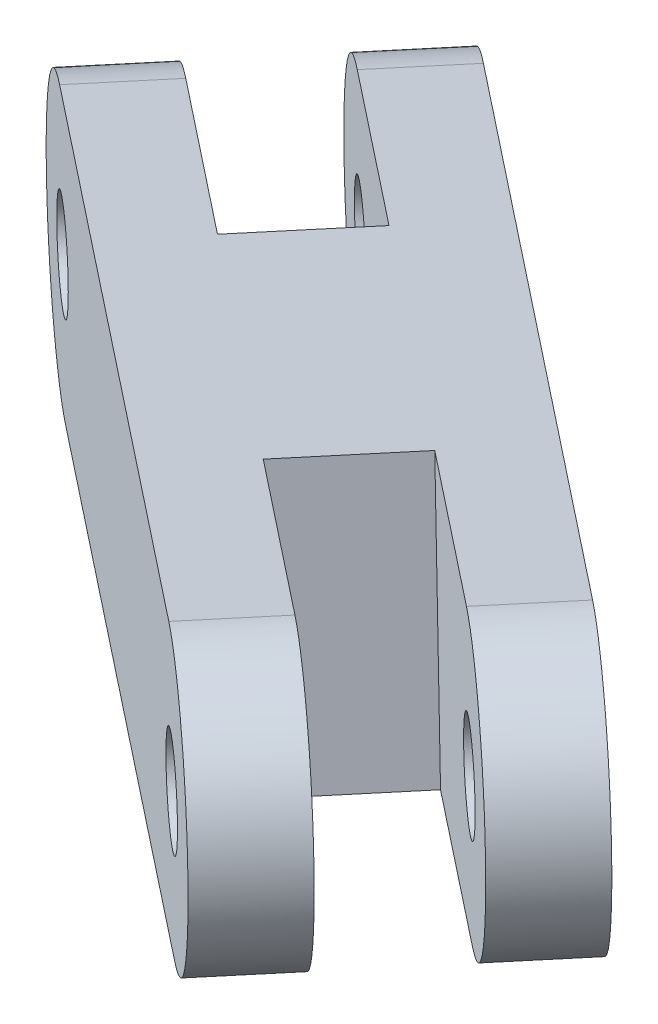
ISO-10303-21;
HEADER;
FILE_DESCRIPTION(('STEP AP214'),'2;1');
FILE_NAME('part.step','',(''),(''),'','','');
FILE_SCHEMA(('AUTOMOTIVE_DESIGN { 1 0 10303 214 1 1 1 1 }'));
ENDSEC;
DATA;
#1=APPLICATION_CONTEXT('core data for automotive mechanical design processes');
#2=APPLICATION_PROTOCOL_DEFINITION('international standard','automotive_design',2000,#1);
#3=PRODUCT_CONTEXT('',#1,'mechanical');
#4=PRODUCT('Part','Part','',(#3));
#5=PRODUCT_RELATED_PRODUCT_CATEGORY('part','',(#4));
#6=PRODUCT_DEFINITION_FORMATION('','',#4);
#7=PRODUCT_DEFINITION_CONTEXT('part definition',#1,'design');
#8=PRODUCT_DEFINITION('design','',#6,#7);
#9=PRODUCT_DEFINITION_SHAPE('','',#8);
#10=(LENGTH_UNIT() NAMED_UNIT(*) SI_UNIT(.MILLI.,.METRE.));
#11=(NAMED_UNIT(*) PLANE_ANGLE_UNIT() SI_UNIT($,.RADIAN.));
#12=(NAMED_UNIT(*) SI_UNIT($,.STERADIAN.) SOLID_ANGLE_UNIT());
#13=UNCERTAINTY_MEASURE_WITH_UNIT(LENGTH_MEASURE(1.E-05),#10,'distance_accuracy_value','');
#14=(GEOMETRIC_REPRESENTATION_CONTEXT(3) GLOBAL_UNCERTAINTY_ASSIGNED_CONTEXT((#13)) GLOBAL_UNIT_ASSIGNED_CONTEXT((#10,
#11,#12)) REPRESENTATION_CONTEXT('',''));
#15=CARTESIAN_POINT('',(0.,0.,0.));
#16=DIRECTION('',(0.,0.,1.));
#17=DIRECTION('',(1.,0.,0.));
#18=AXIS2_PLACEMENT_3D('',#15,#16,#17);
#19=CARTESIAN_POINT('',(-10.2761149388828,3.16770857727477,-37.3203668764532));
#20=DIRECTION('',(-0.642787609686537,0.,0.76604444311898));
#21=DIRECTION('',(0.76604444311898,0.,0.642787609686537));
#22=AXIS2_PLACEMENT_3D('',#19,#20,#21);
#23=CYLINDRICAL_SURFACE('',#22,4.699);
#24=DIRECTION('',(-0.642787609686537,0.,0.76604444311898));
#25=VECTOR('',#24,1.);
#26=CARTESIAN_POINT('',(-9.63957530738413,-1.45723833501612,-36.786246706433));
#27=LINE('',#26,#25);
#28=CARTESIAN_POINT('',(-9.63957530738413,-1.45723833501612,-36.786246706433));
#29=VERTEX_POINT('',#28);
#30=CARTESIAN_POINT('',(-11.6804259681389,-1.45723833501612,-34.3540555995302));
#31=VERTEX_POINT('',#30);
#32=EDGE_CURVE('E224',#29,#31,#27,.T.);
#33=ORIENTED_EDGE('',*,*,#32,.T.);
#34=CARTESIAN_POINT('',(-12.3169655996375,3.16770857727477,-34.8881757695505));
#35=DIRECTION('',(0.642787609686537,0.,-0.76604444311898));
#36=DIRECTION('',(-0.76604444311898,0.,-0.642787609686537));
#37=AXIS2_PLACEMENT_3D('',#34,#35,#36);
#38=CIRCLE('',#37,4.699);
#39=CARTESIAN_POINT('',(-12.9535052311362,7.79265548956567,-35.4222959395707));
#40=VERTEX_POINT('',#39);
#41=EDGE_CURVE('E174',#40,#31,#38,.F.);
#42=ORIENTED_EDGE('',*,*,#41,.F.);
#43=DIRECTION('',(-0.642787609686537,0.,0.76604444311898));
#44=VECTOR('',#43,1.);
#45=CARTESIAN_POINT('',(-10.9126545703814,7.79265548956567,-37.8544870464735));
#46=LINE('',#45,#44);
#47=CARTESIAN_POINT('',(-10.9126545703814,7.79265548956567,-37.8544870464735));
#48=VERTEX_POINT('',#47);
#49=EDGE_CURVE('E213',#48,#40,#46,.T.);
#50=ORIENTED_EDGE('',*,*,#49,.F.);
#51=CARTESIAN_POINT('',(-10.2761149388828,3.16770857727477,-37.3203668764532));
#52=DIRECTION('',(-0.642787609686537,0.,0.76604444311898));
#53=DIRECTION('',(0.76604444311898,0.,0.642787609686537));
#54=AXIS2_PLACEMENT_3D('',#51,#52,#53);
#55=CIRCLE('',#54,4.699);
#56=EDGE_CURVE('E200',#48,#29,#55,.T.);
#57=ORIENTED_EDGE('',*,*,#56,.T.);
#58=EDGE_LOOP('',(#33,#42,#50,#57));
#59=FACE_BOUND('',#58,.T.);
#60=ADVANCED_FACE('F34',(#59),#23,.T.);
#61=CARTESIAN_POINT('',(13.7884699315781,8.81173628923763,-17.1277825872153));
#62=DIRECTION('',(-0.642787609686537,0.,0.76604444311898));
#63=DIRECTION('',(0.76604444311898,0.,0.642787609686537));
#64=AXIS2_PLACEMENT_3D('',#61,#62,#63);
#65=CYLINDRICAL_SURFACE('',#64,4.699);
#66=CARTESIAN_POINT('',(8.97206237219681,8.81173628923763,-11.3878115749248));
#67=DIRECTION('',(-0.64278760968654,0.,0.766044443118978));
#68=DIRECTION('',(0.766044443118978,0.,0.64278760968654));
#69=AXIS2_PLACEMENT_3D('',#66,#67,#68);
#70=CIRCLE('',#69,4.699);
#71=CARTESIAN_POINT('',(8.33552274069816,13.4366832015285,-11.921931744945));
#72=VERTEX_POINT('',#71);
#73=CARTESIAN_POINT('',(9.60860200369546,4.18678937694673,-10.8536914049045));
#74=VERTEX_POINT('',#73);
#75=EDGE_CURVE('E165',#72,#74,#70,.F.);
#76=ORIENTED_EDGE('',*,*,#75,.F.);
#77=DIRECTION('',(-0.642787609686537,0.,0.76604444311898));
#78=VECTOR('',#77,1.);
#79=CARTESIAN_POINT('',(13.1519303000794,13.4366832015285,-17.6619027572355));
#80=LINE('',#79,#78);
#81=CARTESIAN_POINT('',(6.29467207994342,13.4366832015285,-9.48974063804226));
#82=VERTEX_POINT('',#81);
#83=EDGE_CURVE('E219',#72,#82,#80,.T.);
#84=ORIENTED_EDGE('',*,*,#83,.T.);
#85=CARTESIAN_POINT('',(6.93121171144207,8.81173628923763,-8.95562046802202));
#86=DIRECTION('',(-0.642787609686537,0.,0.76604444311898));
#87=DIRECTION('',(-0.76604444311898,0.,-0.642787609686537));
#88=AXIS2_PLACEMENT_3D('',#85,#86,#87);
#89=CIRCLE('',#88,4.699);
#90=CARTESIAN_POINT('',(7.56775134294073,4.18678937694673,-8.42150029800179));
#91=VERTEX_POINT('',#90);
#92=EDGE_CURVE('E188',#91,#82,#89,.T.);
#93=ORIENTED_EDGE('',*,*,#92,.F.);
#94=DIRECTION('',(-0.642787609686537,0.,0.76604444311898));
#95=VECTOR('',#94,1.);
#96=CARTESIAN_POINT('',(14.4250095630767,4.18678937694673,-16.5936624171951));
#97=LINE('',#96,#95);
#98=EDGE_CURVE('E223',#74,#91,#97,.T.);
#99=ORIENTED_EDGE('',*,*,#98,.F.);
#100=EDGE_LOOP('',(#76,#84,#93,#99));
#101=FACE_BOUND('',#100,.T.);
#102=ADVANCED_FACE('F274',(#101),#65,.T.);
#103=CARTESIAN_POINT('',(-10.2761149388828,3.16770857727477,-37.3203668764532));
#104=DIRECTION('',(-0.642787609686537,0.,0.76604444311898));
#105=DIRECTION('',(0.76604444311898,0.,0.642787609686537));
#106=AXIS2_PLACEMENT_3D('',#103,#104,#105);
#107=CYLINDRICAL_SURFACE('',#106,1.651);
#108=CARTESIAN_POINT('',(-12.3169655996375,3.16770857727477,-34.8881757695505));
#109=DIRECTION('',(0.642787609686537,0.,-0.76604444311898));
#110=DIRECTION('',(-0.76604444311898,0.,-0.642787609686537));
#111=AXIS2_PLACEMENT_3D('',#108,#109,#110);
#112=CIRCLE('',#111,1.651);
#113=CARTESIAN_POINT('',(-13.581704975227,3.16770857727477,-35.9494181131429));
#114=VERTEX_POINT('',#113);
#115=EDGE_CURVE('E171',#114,#114,#112,.F.);
#116=ORIENTED_EDGE('',*,*,#115,.T.);
#117=EDGE_LOOP('',(#116));
#118=FACE_BOUND('',#117,.T.);
#119=CARTESIAN_POINT('',(-10.2761149388828,3.16770857727477,-37.3203668764532));
#120=DIRECTION('',(-0.642787609686537,0.,0.76604444311898));
#121=DIRECTION('',(0.76604444311898,0.,0.642787609686537));
#122=AXIS2_PLACEMENT_3D('',#119,#120,#121);
#123=CIRCLE('',#122,1.651);
#124=CARTESIAN_POINT('',(-9.01137556329335,3.16770857727477,-36.2591245328608));
#125=VERTEX_POINT('',#124);
#126=EDGE_CURVE('E197',#125,#125,#123,.T.);
#127=ORIENTED_EDGE('',*,*,#126,.F.);
#128=EDGE_LOOP('',(#127));
#129=FACE_BOUND('',#128,.T.);
#130=ADVANCED_FACE('F285',(#118,#129),#107,.F.);
#131=CARTESIAN_POINT('',(13.7884699315781,8.81173628923763,-17.1277825872153));
#132=DIRECTION('',(-0.642787609686537,0.,0.76604444311898));
#133=DIRECTION('',(0.76604444311898,0.,0.642787609686537));
#134=AXIS2_PLACEMENT_3D('',#131,#132,#133);
#135=CYLINDRICAL_SURFACE('',#134,1.651);
#136=CARTESIAN_POINT('',(8.97206237219681,8.81173628923763,-11.3878115749248));
#137=DIRECTION('',(-0.64278760968654,0.,0.766044443118978));
#138=DIRECTION('',(0.766044443118978,0.,0.64278760968654));
#139=AXIS2_PLACEMENT_3D('',#136,#137,#138);
#140=CIRCLE('',#139,1.651);
#141=CARTESIAN_POINT('',(10.2368017477862,8.81173628923763,-10.3265692313323));
#142=VERTEX_POINT('',#141);
#143=EDGE_CURVE('E162',#142,#142,#140,.F.);
#144=ORIENTED_EDGE('',*,*,#143,.T.);
#145=EDGE_LOOP('',(#144));
#146=FACE_BOUND('',#145,.T.);
#147=CARTESIAN_POINT('',(6.93121171144207,8.81173628923763,-8.95562046802202));
#148=DIRECTION('',(-0.642787609686537,0.,0.76604444311898));
#149=DIRECTION('',(0.76604444311898,0.,0.642787609686537));
#150=AXIS2_PLACEMENT_3D('',#147,#148,#149);
#151=CIRCLE('',#150,1.651);
#152=CARTESIAN_POINT('',(8.19595108703151,8.81173628923763,-7.89437812442955));
#153=VERTEX_POINT('',#152);
#154=EDGE_CURVE('E176',#153,#153,#151,.T.);
#155=ORIENTED_EDGE('',*,*,#154,.T.);
#156=EDGE_LOOP('',(#155));
#157=FACE_BOUND('',#156,.T.);
#158=ADVANCED_FACE('F282',(#146,#157),#135,.F.);
#159=CARTESIAN_POINT('',(-15.092522498264,3.16770857727477,-31.5803958641627));
#160=DIRECTION('',(-0.642787609686537,0.,0.76604444311898));
#161=DIRECTION('',(0.76604444311898,0.,0.642787609686537));
#162=AXIS2_PLACEMENT_3D('',#159,#160,#161);
#163=CIRCLE('',#162,4.699);
#164=CARTESIAN_POINT('',(-14.4559828667654,-1.45723833501612,-31.0462756941425));
#165=VERTEX_POINT('',#164);
#166=CARTESIAN_POINT('',(-15.7290621297627,7.79265548956567,-32.1145160341829));
#167=VERTEX_POINT('',#166);
#168=EDGE_CURVE('E137',#165,#167,#163,.F.);
#169=ORIENTED_EDGE('',*,*,#168,.F.);
#170=CARTESIAN_POINT('',(-16.4968335275201,-1.45723833501612,-28.6140845872397));
#171=VERTEX_POINT('',#170);
#172=EDGE_CURVE('E212',#165,#171,#27,.T.);
#173=ORIENTED_EDGE('',*,*,#172,.T.);
#174=CARTESIAN_POINT('',(-17.1333731590188,3.16770857727477,-29.14820475726));
#175=DIRECTION('',(-0.642787609686537,0.,0.76604444311898));
#176=DIRECTION('',(0.76604444311898,0.,0.642787609686537));
#177=AXIS2_PLACEMENT_3D('',#174,#175,#176);
#178=CIRCLE('',#177,4.699);
#179=CARTESIAN_POINT('',(-17.7699127905174,7.79265548956567,-29.6823249272802));
#180=VERTEX_POINT('',#179);
#181=EDGE_CURVE('E182',#180,#171,#178,.T.);
#182=ORIENTED_EDGE('',*,*,#181,.F.);
#183=EDGE_CURVE('E215',#167,#180,#46,.T.);
#184=ORIENTED_EDGE('',*,*,#183,.F.);
#185=EDGE_LOOP('',(#169,#173,#182,#184));
#186=FACE_BOUND('',#185,.T.);
#187=ADVANCED_FACE('F36',(#186),#23,.T.);
#188=CARTESIAN_POINT('',(-10.9126545703814,7.79265548956567,-37.8544870464735));
#189=DIRECTION('',(-0.135462786018015,0.984240670842924,-0.113666773785962));
#190=DIRECTION('',(-0.990661215392179,-0.136346456931197,0.));
#191=AXIS2_PLACEMENT_3D('',#188,#189,#190);
#192=PLANE('',#191);
#193=DIRECTION('',(-0.753972096590918,-0.176834108301175,-0.632657708167397));
#194=VECTOR('',#193,1.);
#195=CARTESIAN_POINT('',(-16.4964201130169,6.96171201465845,-38.3951545102493));
#196=LINE('',#195,#194);
#197=CARTESIAN_POINT('',(-5.96342992364179,9.43208450762586,-29.5569263271508));
#198=VERTEX_POINT('',#197);
#199=EDGE_CURVE('E131',#198,#40,#196,.T.);
#200=ORIENTED_EDGE('',*,*,#199,.F.);
#201=DIRECTION('',(0.642787609686539,0.,-0.766044443118978));
#202=VECTOR('',#201,1.);
#203=CARTESIAN_POINT('',(-8.73898682226827,9.43208450762586,-26.249146421763));
#204=LINE('',#203,#202);
#205=CARTESIAN_POINT('',(-8.73898682226827,9.43208450762586,-26.249146421763));
#206=VERTEX_POINT('',#205);
#207=EDGE_CURVE('E126',#206,#198,#204,.T.);
#208=ORIENTED_EDGE('',*,*,#207,.F.);
#209=DIRECTION('',(0.753972096590919,0.176834108301175,0.632657708167397));
#210=VECTOR('',#209,1.);
#211=CARTESIAN_POINT('',(-19.2719770116434,6.96171201465845,-35.0873746048616));
#212=LINE('',#211,#210);
#213=EDGE_CURVE('E134',#167,#206,#212,.T.);
#214=ORIENTED_EDGE('',*,*,#213,.F.);
#215=ORIENTED_EDGE('',*,*,#183,.T.);
#216=DIRECTION('',(-0.753972096590919,-0.176834108301175,-0.632657708167397));
#217=VECTOR('',#216,1.);
#218=CARTESIAN_POINT('',(-17.7699127905174,7.79265548956567,-29.6823249272802));
#219=LINE('',#218,#217);
#220=EDGE_CURVE('E191',#82,#180,#219,.T.);
#221=ORIENTED_EDGE('',*,*,#220,.F.);
#222=ORIENTED_EDGE('',*,*,#83,.F.);
#223=DIRECTION('',(0.753972096590917,0.176834108301175,0.632657708167399));
#224=VECTOR('',#223,1.);
#225=CARTESIAN_POINT('',(11.8784376225789,14.2676266764357,-8.94907317426639));
#226=LINE('',#225,#224);
#227=CARTESIAN_POINT('',(1.34544743320377,11.7972541834683,-17.787301357365));
#228=VERTEX_POINT('',#227);
#229=EDGE_CURVE('E154',#228,#72,#226,.T.);
#230=ORIENTED_EDGE('',*,*,#229,.F.);
#231=DIRECTION('',(-0.642787609686539,0.,0.766044443118978));
#232=VECTOR('',#231,1.);
#233=CARTESIAN_POINT('',(4.12100433183025,11.7972541834683,-21.0950812627527));
#234=LINE('',#233,#232);
#235=CARTESIAN_POINT('',(4.12100433183025,11.7972541834683,-21.0950812627527));
#236=VERTEX_POINT('',#235);
#237=EDGE_CURVE('E151',#236,#228,#234,.T.);
#238=ORIENTED_EDGE('',*,*,#237,.F.);
#239=DIRECTION('',(-0.753972096590917,-0.176834108301175,-0.632657708167399));
#240=VECTOR('',#239,1.);
#241=CARTESIAN_POINT('',(14.6539945212054,14.2676266764357,-12.2568530796541));
#242=LINE('',#241,#240);
#243=CARTESIAN_POINT('',(11.1110796393246,13.4366832015285,-15.2297116503328));
#244=VERTEX_POINT('',#243);
#245=EDGE_CURVE('E149',#244,#236,#242,.T.);
#246=ORIENTED_EDGE('',*,*,#245,.F.);
#247=CARTESIAN_POINT('',(13.1519303000794,13.4366832015285,-17.6619027572355));
#248=VERTEX_POINT('',#247);
#249=EDGE_CURVE('E216',#248,#244,#80,.T.);
#250=ORIENTED_EDGE('',*,*,#249,.F.);
#251=DIRECTION('',(-0.753972096590919,-0.176834108301175,-0.632657708167397));
#252=VECTOR('',#251,1.);
#253=CARTESIAN_POINT('',(-10.9126545703814,7.79265548956567,-37.8544870464735));
#254=LINE('',#253,#252);
#255=EDGE_CURVE('E209',#248,#48,#254,.T.);
#256=ORIENTED_EDGE('',*,*,#255,.T.);
#257=ORIENTED_EDGE('',*,*,#49,.T.);
#258=EDGE_LOOP('',(#200,#208,#214,#215,#221,#222,#230,#238,#246,#250,#256,#257));
#259=FACE_BOUND('',#258,.T.);
#260=ADVANCED_FACE('F142',(#259),#192,.T.);
#261=CARTESIAN_POINT('',(11.7476192708233,8.81173628923763,-14.6955914803125));
#262=DIRECTION('',(0.642787609686539,0.,-0.766044443118978));
#263=DIRECTION('',(-0.766044443118978,0.,-0.642787609686539));
#264=AXIS2_PLACEMENT_3D('',#261,#262,#263);
#265=CIRCLE('',#264,4.699);
#266=CARTESIAN_POINT('',(12.3841589023219,4.18678937694673,-14.1614713102923));
#267=VERTEX_POINT('',#266);
#268=EDGE_CURVE('E160',#267,#244,#265,.F.);
#269=ORIENTED_EDGE('',*,*,#268,.F.);
#270=CARTESIAN_POINT('',(14.4250095630767,4.18678937694673,-16.5936624171951));
#271=VERTEX_POINT('',#270);
#272=EDGE_CURVE('E220',#271,#267,#97,.T.);
#273=ORIENTED_EDGE('',*,*,#272,.F.);
#274=CARTESIAN_POINT('',(13.7884699315781,8.81173628923763,-17.1277825872153));
#275=DIRECTION('',(-0.642787609686537,0.,0.76604444311898));
#276=DIRECTION('',(-0.76604444311898,0.,-0.642787609686537));
#277=AXIS2_PLACEMENT_3D('',#274,#275,#276);
#278=CIRCLE('',#277,4.699);
#279=EDGE_CURVE('E206',#271,#248,#278,.T.);
#280=ORIENTED_EDGE('',*,*,#279,.T.);
#281=ORIENTED_EDGE('',*,*,#249,.T.);
#282=EDGE_LOOP('',(#269,#273,#280,#281));
#283=FACE_BOUND('',#282,.T.);
#284=ADVANCED_FACE('F249',(#283),#65,.T.);
#285=CARTESIAN_POINT('',(-9.63957530738413,-1.45723833501612,-36.786246706433));
#286=DIRECTION('',(0.135462786018015,-0.984240670842924,0.113666773785962));
#287=DIRECTION('',(0.990661215392179,0.136346456931197,0.));
#288=AXIS2_PLACEMENT_3D('',#285,#286,#287);
#289=PLANE('',#288);
#290=DIRECTION('',(0.753972096590919,0.176834108301175,0.632657708167397));
#291=VECTOR('',#290,1.);
#292=CARTESIAN_POINT('',(-11.6804259681389,-1.45723833501612,-34.3540555995302));
#293=LINE('',#292,#291);
#294=CARTESIAN_POINT('',(-4.69035066064449,0.182190683044065,-28.4886859871103));
#295=VERTEX_POINT('',#294);
#296=EDGE_CURVE('E172',#31,#295,#293,.T.);
#297=ORIENTED_EDGE('',*,*,#296,.F.);
#298=ORIENTED_EDGE('',*,*,#32,.F.);
#299=DIRECTION('',(0.753972096590918,0.176834108301174,0.632657708167397));
#300=VECTOR('',#299,1.);
#301=CARTESIAN_POINT('',(-9.63957530738413,-1.45723833501612,-36.786246706433));
#302=LINE('',#301,#300);
#303=EDGE_CURVE('E203',#29,#271,#302,.T.);
#304=ORIENTED_EDGE('',*,*,#303,.T.);
#305=ORIENTED_EDGE('',*,*,#272,.T.);
#306=DIRECTION('',(0.753972096590917,0.176834108301174,0.632657708167399));
#307=VECTOR('',#306,1.);
#308=CARTESIAN_POINT('',(-11.6804259681389,-1.45723833501612,-34.3540555995303));
#309=LINE('',#308,#307);
#310=CARTESIAN_POINT('',(5.39408359482755,2.54736035888654,-20.0268409227122));
#311=VERTEX_POINT('',#310);
#312=EDGE_CURVE('E158',#311,#267,#309,.T.);
#313=ORIENTED_EDGE('',*,*,#312,.F.);
#314=DIRECTION('',(0.642787609686539,0.,-0.766044443118979));
#315=VECTOR('',#314,1.);
#316=CARTESIAN_POINT('',(7.43493425558229,2.54736035888655,-22.459032029615));
#317=LINE('',#316,#315);
#318=CARTESIAN_POINT('',(2.61852669620108,2.54736035888654,-16.7190610173245));
#319=VERTEX_POINT('',#318);
#320=EDGE_CURVE('E42',#319,#311,#317,.T.);
#321=ORIENTED_EDGE('',*,*,#320,.F.);
#322=DIRECTION('',(-0.753972096590917,-0.176834108301174,-0.632657708167399));
#323=VECTOR('',#322,1.);
#324=CARTESIAN_POINT('',(-14.4559828667653,-1.45723833501613,-31.0462756941425));
#325=LINE('',#324,#323);
#326=EDGE_CURVE('E163',#74,#319,#325,.T.);
#327=ORIENTED_EDGE('',*,*,#326,.F.);
#328=ORIENTED_EDGE('',*,*,#98,.T.);
#329=DIRECTION('',(0.753972096590918,0.176834108301174,0.632657708167397));
#330=VECTOR('',#329,1.);
#331=CARTESIAN_POINT('',(-16.4968335275201,-1.45723833501612,-28.6140845872397));
#332=LINE('',#331,#330);
#333=EDGE_CURVE('E185',#171,#91,#332,.T.);
#334=ORIENTED_EDGE('',*,*,#333,.F.);
#335=ORIENTED_EDGE('',*,*,#172,.F.);
#336=DIRECTION('',(-0.753972096590919,-0.176834108301175,-0.632657708167397));
#337=VECTOR('',#336,1.);
#338=CARTESIAN_POINT('',(-14.4559828667654,-1.45723833501612,-31.0462756941425));
#339=LINE('',#338,#337);
#340=CARTESIAN_POINT('',(-7.46590755927096,0.182190683044064,-25.1809060817226));
#341=VERTEX_POINT('',#340);
#342=EDGE_CURVE('E168',#341,#165,#339,.T.);
#343=ORIENTED_EDGE('',*,*,#342,.F.);
#344=DIRECTION('',(-0.642787609686539,0.,0.766044443118979));
#345=VECTOR('',#344,1.);
#346=CARTESIAN_POINT('',(-2.64949999988974,0.182190683044066,-30.9208770940131));
#347=LINE('',#346,#345);
#348=EDGE_CURVE('E11',#295,#341,#347,.T.);
#349=ORIENTED_EDGE('',*,*,#348,.F.);
#350=EDGE_LOOP('',(#297,#298,#304,#305,#313,#321,#327,#328,#334,#335,#343,#349));
#351=FACE_BOUND('',#350,.T.);
#352=ADVANCED_FACE('F242',(#351),#289,.T.);
#353=CARTESIAN_POINT('',(-10.2761149388828,3.16770857727477,-37.3203668764532));
#354=DIRECTION('',(-0.642787609686537,0.,0.76604444311898));
#355=DIRECTION('',(0.76604444311898,0.,0.642787609686537));
#356=AXIS2_PLACEMENT_3D('',#353,#354,#355);
#357=PLANE('',#356);
#358=CARTESIAN_POINT('',(13.7884699315781,8.81173628923763,-17.1277825872153));
#359=DIRECTION('',(-0.642787609686537,0.,0.76604444311898));
#360=DIRECTION('',(0.76604444311898,0.,0.642787609686537));
#361=AXIS2_PLACEMENT_3D('',#358,#359,#360);
#362=CIRCLE('',#361,1.651);
#363=CARTESIAN_POINT('',(15.0532093071675,8.81173628923763,-16.0665402436228));
#364=VERTEX_POINT('',#363);
#365=EDGE_CURVE('E194',#364,#364,#362,.T.);
#366=ORIENTED_EDGE('',*,*,#365,.T.);
#367=EDGE_LOOP('',(#366));
#368=FACE_BOUND('',#367,.T.);
#369=ORIENTED_EDGE('',*,*,#126,.T.);
#370=EDGE_LOOP('',(#369));
#371=FACE_BOUND('',#370,.T.);
#372=ORIENTED_EDGE('',*,*,#56,.F.);
#373=ORIENTED_EDGE('',*,*,#255,.F.);
#374=ORIENTED_EDGE('',*,*,#279,.F.);
#375=ORIENTED_EDGE('',*,*,#303,.F.);
#376=EDGE_LOOP('',(#372,#373,#374,#375));
#377=FACE_BOUND('',#376,.T.);
#378=ADVANCED_FACE('F255',(#368,#371,#377),#357,.F.);
#379=CARTESIAN_POINT('',(-15.092522498264,3.16770857727477,-31.5803958641627));
#380=DIRECTION('',(-0.642787609686537,0.,0.76604444311898));
#381=DIRECTION('',(0.76604444311898,0.,0.642787609686537));
#382=AXIS2_PLACEMENT_3D('',#379,#380,#381);
#383=CIRCLE('',#382,1.651);
#384=CARTESIAN_POINT('',(-13.8277831226746,3.16770857727477,-30.5191535205702));
#385=VERTEX_POINT('',#384);
#386=EDGE_CURVE('E167',#385,#385,#383,.F.);
#387=ORIENTED_EDGE('',*,*,#386,.T.);
#388=EDGE_LOOP('',(#387));
#389=FACE_BOUND('',#388,.T.);
#390=CARTESIAN_POINT('',(-17.1333731590188,3.16770857727477,-29.14820475726));
#391=DIRECTION('',(-0.642787609686537,0.,0.76604444311898));
#392=DIRECTION('',(0.76604444311898,0.,0.642787609686537));
#393=AXIS2_PLACEMENT_3D('',#390,#391,#392);
#394=CIRCLE('',#393,1.651);
#395=CARTESIAN_POINT('',(-15.8686337834293,3.16770857727477,-28.0869624136675));
#396=VERTEX_POINT('',#395);
#397=EDGE_CURVE('E179',#396,#396,#394,.T.);
#398=ORIENTED_EDGE('',*,*,#397,.T.);
#399=EDGE_LOOP('',(#398));
#400=FACE_BOUND('',#399,.T.);
#401=ADVANCED_FACE('F295',(#389,#400),#107,.F.);
#402=CARTESIAN_POINT('',(11.7476192708233,8.81173628923763,-14.6955914803125));
#403=DIRECTION('',(0.642787609686539,0.,-0.766044443118978));
#404=DIRECTION('',(-0.766044443118978,0.,-0.642787609686539));
#405=AXIS2_PLACEMENT_3D('',#402,#403,#404);
#406=CIRCLE('',#405,1.651);
#407=CARTESIAN_POINT('',(10.4828798952338,8.81173628923763,-15.756833823905));
#408=VERTEX_POINT('',#407);
#409=EDGE_CURVE('E147',#408,#408,#406,.F.);
#410=ORIENTED_EDGE('',*,*,#409,.T.);
#411=EDGE_LOOP('',(#410));
#412=FACE_BOUND('',#411,.T.);
#413=ORIENTED_EDGE('',*,*,#365,.F.);
#414=EDGE_LOOP('',(#413));
#415=FACE_BOUND('',#414,.T.);
#416=ADVANCED_FACE('F287',(#412,#415),#135,.F.);
#417=CARTESIAN_POINT('',(-17.1333731590188,3.16770857727477,-29.14820475726));
#418=DIRECTION('',(-0.642787609686537,0.,0.76604444311898));
#419=DIRECTION('',(0.76604444311898,0.,0.642787609686537));
#420=AXIS2_PLACEMENT_3D('',#417,#418,#419);
#421=PLANE('',#420);
#422=ORIENTED_EDGE('',*,*,#397,.F.);
#423=EDGE_LOOP('',(#422));
#424=FACE_BOUND('',#423,.T.);
#425=ORIENTED_EDGE('',*,*,#181,.T.);
#426=ORIENTED_EDGE('',*,*,#333,.T.);
#427=ORIENTED_EDGE('',*,*,#92,.T.);
#428=ORIENTED_EDGE('',*,*,#220,.T.);
#429=EDGE_LOOP('',(#425,#426,#427,#428));
#430=FACE_BOUND('',#429,.T.);
#431=ORIENTED_EDGE('',*,*,#154,.F.);
#432=EDGE_LOOP('',(#431));
#433=FACE_BOUND('',#432,.T.);
#434=ADVANCED_FACE('F268',(#424,#430,#433),#421,.T.);
#435=CARTESIAN_POINT('',(13.2891470761705,4.01774433027754,-7.76534739205938));
#436=DIRECTION('',(-0.64278760968654,0.,0.766044443118978));
#437=DIRECTION('',(0.766044443118978,0.,0.64278760968654));
#438=AXIS2_PLACEMENT_3D('',#435,#436,#437);
#439=PLANE('',#438);
#440=ORIENTED_EDGE('',*,*,#75,.T.);
#441=ORIENTED_EDGE('',*,*,#326,.T.);
#442=DIRECTION('',(-0.135462786018015,0.984240670842924,-0.113666773785962));
#443=VECTOR('',#442,1.);
#444=CARTESIAN_POINT('',(2.75615688679538,1.54737183731013,-16.6035755751579));
#445=LINE('',#444,#443);
#446=EDGE_CURVE('E140',#319,#228,#445,.T.);
#447=ORIENTED_EDGE('',*,*,#446,.T.);
#448=ORIENTED_EDGE('',*,*,#229,.T.);
#449=EDGE_LOOP('',(#440,#441,#447,#448));
#450=FACE_BOUND('',#449,.T.);
#451=ORIENTED_EDGE('',*,*,#143,.F.);
#452=EDGE_LOOP('',(#451));
#453=FACE_BOUND('',#452,.T.);
#454=ADVANCED_FACE('F276',(#450,#453),#439,.F.);
#455=CARTESIAN_POINT('',(16.064703974797,4.01774433027754,-11.0731272974471));
#456=DIRECTION('',(0.642787609686539,0.,-0.766044443118978));
#457=DIRECTION('',(-0.766044443118978,0.,-0.642787609686539));
#458=AXIS2_PLACEMENT_3D('',#455,#456,#457);
#459=PLANE('',#458);
#460=ORIENTED_EDGE('',*,*,#268,.T.);
#461=ORIENTED_EDGE('',*,*,#245,.T.);
#462=DIRECTION('',(-0.135462786018015,0.984240670842924,-0.113666773785962));
#463=VECTOR('',#462,1.);
#464=CARTESIAN_POINT('',(5.53171378542185,1.54737183731013,-19.9113554805457));
#465=LINE('',#464,#463);
#466=EDGE_CURVE('E56',#311,#236,#465,.T.);
#467=ORIENTED_EDGE('',*,*,#466,.F.);
#468=ORIENTED_EDGE('',*,*,#312,.T.);
#469=EDGE_LOOP('',(#460,#461,#467,#468));
#470=FACE_BOUND('',#469,.T.);
#471=ORIENTED_EDGE('',*,*,#409,.F.);
#472=EDGE_LOOP('',(#471));
#473=FACE_BOUND('',#472,.T.);
#474=ADVANCED_FACE('F243',(#470,#473),#459,.F.);
#475=CARTESIAN_POINT('',(5.53171378542185,1.54737183731013,-19.9113554805457));
#476=DIRECTION('',(-0.753972096590917,-0.176834108301175,-0.632657708167398));
#477=DIRECTION('',(-0.642787609686539,0.,0.766044443118979));
#478=AXIS2_PLACEMENT_3D('',#475,#476,#477);
#479=PLANE('',#478);
#480=ORIENTED_EDGE('',*,*,#320,.T.);
#481=ORIENTED_EDGE('',*,*,#466,.T.);
#482=ORIENTED_EDGE('',*,*,#237,.T.);
#483=ORIENTED_EDGE('',*,*,#446,.F.);
#484=EDGE_LOOP('',(#480,#481,#482,#483));
#485=FACE_BOUND('',#484,.T.);
#486=ADVANCED_FACE('F238',(#485),#479,.F.);
#487=CARTESIAN_POINT('',(-15.0857106594253,-3.28817033149976,-37.2114287280423));
#488=DIRECTION('',(0.642787609686537,0.,-0.76604444311898));
#489=DIRECTION('',(-0.76604444311898,0.,-0.642787609686537));
#490=AXIS2_PLACEMENT_3D('',#487,#488,#489);
#491=PLANE('',#490);
#492=ORIENTED_EDGE('',*,*,#41,.T.);
#493=ORIENTED_EDGE('',*,*,#296,.T.);
#494=DIRECTION('',(-0.135462786018015,0.984240670842924,-0.113666773785962));
#495=VECTOR('',#494,1.);
#496=CARTESIAN_POINT('',(-4.55272047005019,-0.817797838532348,-28.3732005449438));
#497=LINE('',#496,#495);
#498=EDGE_CURVE('E130',#295,#198,#497,.T.);
#499=ORIENTED_EDGE('',*,*,#498,.T.);
#500=ORIENTED_EDGE('',*,*,#199,.T.);
#501=EDGE_LOOP('',(#492,#493,#499,#500));
#502=FACE_BOUND('',#501,.T.);
#503=ORIENTED_EDGE('',*,*,#115,.F.);
#504=EDGE_LOOP('',(#503));
#505=FACE_BOUND('',#504,.T.);
#506=ADVANCED_FACE('F259',(#502,#505),#491,.F.);
#507=CARTESIAN_POINT('',(-17.8612675580518,-3.28817033149976,-33.9036488226545));
#508=DIRECTION('',(-0.642787609686537,0.,0.76604444311898));
#509=DIRECTION('',(0.76604444311898,0.,0.642787609686537));
#510=AXIS2_PLACEMENT_3D('',#507,#508,#509);
#511=PLANE('',#510);
#512=ORIENTED_EDGE('',*,*,#168,.T.);
#513=ORIENTED_EDGE('',*,*,#213,.T.);
#514=DIRECTION('',(-0.135462786018015,0.984240670842924,-0.113666773785962));
#515=VECTOR('',#514,1.);
#516=CARTESIAN_POINT('',(-7.32827736867666,-0.81779783853235,-25.065420639556));
#517=LINE('',#516,#515);
#518=EDGE_CURVE('E49',#341,#206,#517,.T.);
#519=ORIENTED_EDGE('',*,*,#518,.F.);
#520=ORIENTED_EDGE('',*,*,#342,.T.);
#521=EDGE_LOOP('',(#512,#513,#519,#520));
#522=FACE_BOUND('',#521,.T.);
#523=ORIENTED_EDGE('',*,*,#386,.F.);
#524=EDGE_LOOP('',(#523));
#525=FACE_BOUND('',#524,.T.);
#526=ADVANCED_FACE('F135',(#522,#525),#511,.F.);
#527=CARTESIAN_POINT('',(-7.32827736867666,-0.81779783853235,-25.065420639556));
#528=DIRECTION('',(0.753972096590917,0.176834108301175,0.632657708167398));
#529=DIRECTION('',(0.642787609686539,0.,-0.766044443118979));
#530=AXIS2_PLACEMENT_3D('',#527,#528,#529);
#531=PLANE('',#530);
#532=ORIENTED_EDGE('',*,*,#348,.T.);
#533=ORIENTED_EDGE('',*,*,#518,.T.);
#534=ORIENTED_EDGE('',*,*,#207,.T.);
#535=ORIENTED_EDGE('',*,*,#498,.F.);
#536=EDGE_LOOP('',(#532,#533,#534,#535));
#537=FACE_BOUND('',#536,.T.);
#538=ADVANCED_FACE('F123',(#537),#531,.F.);
#539=CLOSED_SHELL('',(#60,#102,#130,#158,#187,#260,#284,#352,#378,#401,#416,#434,#454,#474,#486,
#506,#526,#538));
#540=MANIFOLD_SOLID_BREP('B2',#539);
#541=ADVANCED_BREP_SHAPE_REPRESENTATION('',(#18,#540),#14);
#542=SHAPE_DEFINITION_REPRESENTATION(#9,#541);
ENDSEC;
END-ISO-10303-21;
